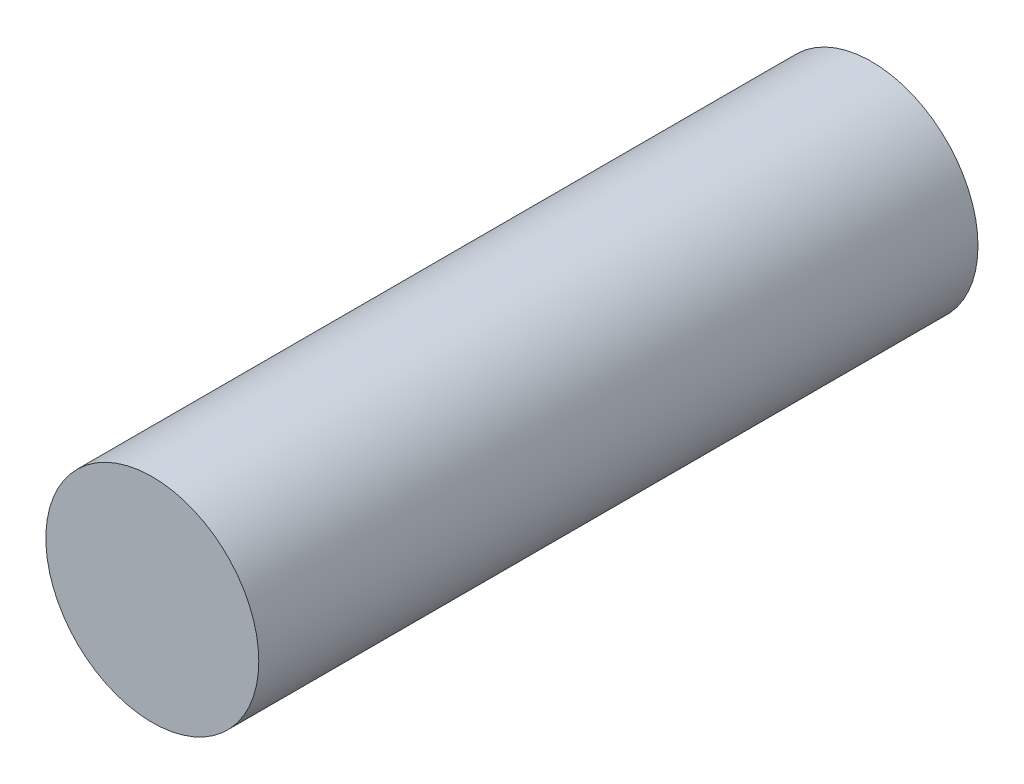
ISO-10303-21;
HEADER;
FILE_DESCRIPTION(('STEP AP214'),'2;1');
FILE_NAME('part.step','',(''),(''),'','','');
FILE_SCHEMA(('AUTOMOTIVE_DESIGN { 1 0 10303 214 1 1 1 1 }'));
ENDSEC;
DATA;
#1=APPLICATION_CONTEXT('core data for automotive mechanical design processes');
#2=APPLICATION_PROTOCOL_DEFINITION('international standard','automotive_design',2000,#1);
#3=PRODUCT_CONTEXT('',#1,'mechanical');
#4=PRODUCT('Part','Part','',(#3));
#5=PRODUCT_RELATED_PRODUCT_CATEGORY('part','',(#4));
#6=PRODUCT_DEFINITION_FORMATION('','',#4);
#7=PRODUCT_DEFINITION_CONTEXT('part definition',#1,'design');
#8=PRODUCT_DEFINITION('design','',#6,#7);
#9=PRODUCT_DEFINITION_SHAPE('','',#8);
#10=(LENGTH_UNIT() NAMED_UNIT(*) SI_UNIT(.MILLI.,.METRE.));
#11=(NAMED_UNIT(*) PLANE_ANGLE_UNIT() SI_UNIT($,.RADIAN.));
#12=(NAMED_UNIT(*) SI_UNIT($,.STERADIAN.) SOLID_ANGLE_UNIT());
#13=UNCERTAINTY_MEASURE_WITH_UNIT(LENGTH_MEASURE(1.E-05),#10,'distance_accuracy_value','');
#14=(GEOMETRIC_REPRESENTATION_CONTEXT(3) GLOBAL_UNCERTAINTY_ASSIGNED_CONTEXT((#13)) GLOBAL_UNIT_ASSIGNED_CONTEXT((#10,
#11,#12)) REPRESENTATION_CONTEXT('',''));
#15=CARTESIAN_POINT('',(0.,0.,0.));
#16=DIRECTION('',(0.,0.,1.));
#17=DIRECTION('',(1.,0.,0.));
#18=AXIS2_PLACEMENT_3D('',#15,#16,#17);
#19=CARTESIAN_POINT('',(0.,0.,32.258));
#20=DIRECTION('',(0.,0.,-1.));
#21=DIRECTION('',(-1.,0.,0.));
#22=AXIS2_PLACEMENT_3D('',#19,#20,#21);
#23=CYLINDRICAL_SURFACE('',#22,4.7752);
#24=CARTESIAN_POINT('',(0.,0.,32.258));
#25=DIRECTION('',(0.,0.,1.));
#26=DIRECTION('',(1.,0.,0.));
#27=AXIS2_PLACEMENT_3D('',#24,#25,#26);
#28=CIRCLE('',#27,4.7752);
#29=CARTESIAN_POINT('',(4.7752,0.,32.258));
#30=VERTEX_POINT('',#29);
#31=EDGE_CURVE('E10',#30,#30,#28,.T.);
#32=ORIENTED_EDGE('',*,*,#31,.F.);
#33=EDGE_LOOP('',(#32));
#34=FACE_BOUND('',#33,.T.);
#35=CARTESIAN_POINT('',(0.,0.,0.));
#36=DIRECTION('',(0.,0.,1.));
#37=DIRECTION('',(1.,0.,0.));
#38=AXIS2_PLACEMENT_3D('',#35,#36,#37);
#39=CIRCLE('',#38,4.7752);
#40=CARTESIAN_POINT('',(4.7752,0.,0.));
#41=VERTEX_POINT('',#40);
#42=EDGE_CURVE('E40',#41,#41,#39,.T.);
#43=ORIENTED_EDGE('',*,*,#42,.T.);
#44=EDGE_LOOP('',(#43));
#45=FACE_BOUND('',#44,.T.);
#46=ADVANCED_FACE('F37',(#34,#45),#23,.T.);
#47=CARTESIAN_POINT('',(0.,0.,32.258));
#48=DIRECTION('',(0.,0.,1.));
#49=DIRECTION('',(1.,0.,0.));
#50=AXIS2_PLACEMENT_3D('',#47,#48,#49);
#51=PLANE('',#50);
#52=ORIENTED_EDGE('',*,*,#31,.T.);
#53=EDGE_LOOP('',(#52));
#54=FACE_BOUND('',#53,.T.);
#55=ADVANCED_FACE('F54',(#54),#51,.T.);
#56=CARTESIAN_POINT('',(0.,0.,0.));
#57=DIRECTION('',(0.,0.,1.));
#58=DIRECTION('',(1.,0.,0.));
#59=AXIS2_PLACEMENT_3D('',#56,#57,#58);
#60=PLANE('',#59);
#61=ORIENTED_EDGE('',*,*,#42,.F.);
#62=EDGE_LOOP('',(#61));
#63=FACE_BOUND('',#62,.T.);
#64=ADVANCED_FACE('F52',(#63),#60,.F.);
#65=CLOSED_SHELL('',(#46,#55,#64));
#66=MANIFOLD_SOLID_BREP('B2',#65);
#67=ADVANCED_BREP_SHAPE_REPRESENTATION('',(#18,#66),#14);
#68=SHAPE_DEFINITION_REPRESENTATION(#9,#67);
ENDSEC;
END-ISO-10303-21;
